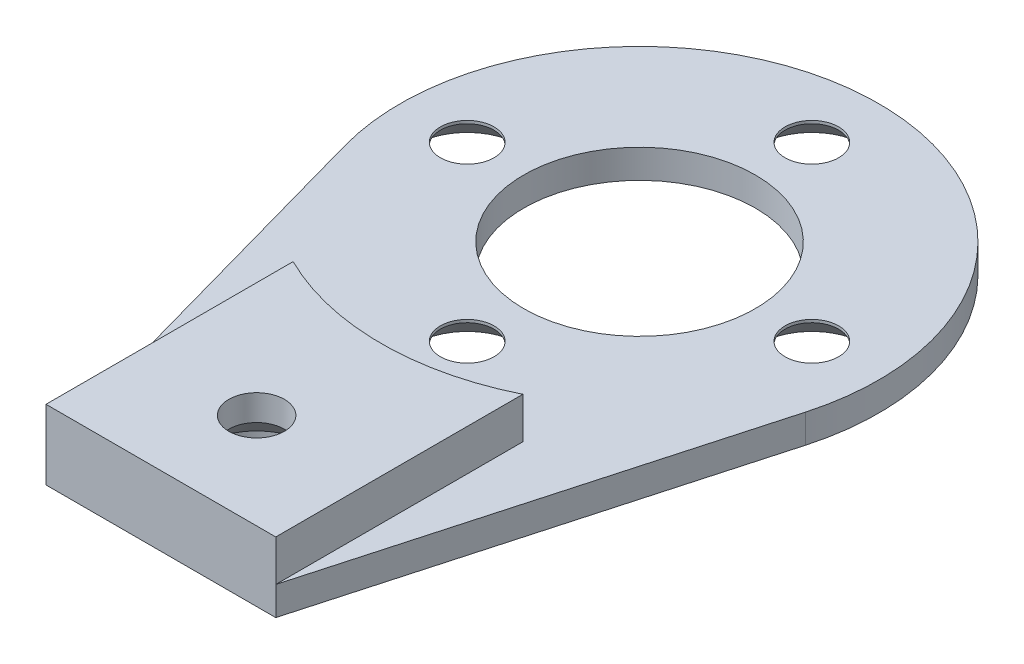
ISO-10303-21;
HEADER;
FILE_DESCRIPTION(('STEP AP214'),'2;1');
FILE_NAME('part.step','',(''),(''),'','','');
FILE_SCHEMA(('AUTOMOTIVE_DESIGN { 1 0 10303 214 1 1 1 1 }'));
ENDSEC;
DATA;
#1=APPLICATION_CONTEXT('core data for automotive mechanical design processes');
#2=APPLICATION_PROTOCOL_DEFINITION('international standard','automotive_design',2000,#1);
#3=PRODUCT_CONTEXT('',#1,'mechanical');
#4=PRODUCT('Part','Part','',(#3));
#5=PRODUCT_RELATED_PRODUCT_CATEGORY('part','',(#4));
#6=PRODUCT_DEFINITION_FORMATION('','',#4);
#7=PRODUCT_DEFINITION_CONTEXT('part definition',#1,'design');
#8=PRODUCT_DEFINITION('design','',#6,#7);
#9=PRODUCT_DEFINITION_SHAPE('','',#8);
#10=(LENGTH_UNIT() NAMED_UNIT(*) SI_UNIT(.MILLI.,.METRE.));
#11=(NAMED_UNIT(*) PLANE_ANGLE_UNIT() SI_UNIT($,.RADIAN.));
#12=(NAMED_UNIT(*) SI_UNIT($,.STERADIAN.) SOLID_ANGLE_UNIT());
#13=UNCERTAINTY_MEASURE_WITH_UNIT(LENGTH_MEASURE(1.E-05),#10,'distance_accuracy_value','');
#14=(GEOMETRIC_REPRESENTATION_CONTEXT(3) GLOBAL_UNCERTAINTY_ASSIGNED_CONTEXT((#13)) GLOBAL_UNIT_ASSIGNED_CONTEXT((#10,
#11,#12)) REPRESENTATION_CONTEXT('',''));
#15=CARTESIAN_POINT('',(0.,0.,0.));
#16=DIRECTION('',(0.,0.,1.));
#17=DIRECTION('',(1.,0.,0.));
#18=AXIS2_PLACEMENT_3D('',#15,#16,#17);
#19=CARTESIAN_POINT('',(0.,1.5,0.));
#20=DIRECTION('',(0.,-1.,0.));
#21=DIRECTION('',(0.,0.,-1.));
#22=AXIS2_PLACEMENT_3D('',#19,#20,#21);
#23=CYLINDRICAL_SURFACE('',#22,12.5);
#24=CARTESIAN_POINT('',(0.,0.,0.));
#25=DIRECTION('',(0.,1.,0.));
#26=DIRECTION('',(0.,0.,1.));
#27=AXIS2_PLACEMENT_3D('',#24,#25,#26);
#28=CIRCLE('',#27,12.5);
#29=CARTESIAN_POINT('',(12.0398269377179,0.,3.3604415349477));
#30=VERTEX_POINT('',#29);
#31=CARTESIAN_POINT('',(-12.0398269377179,0.,3.3604415349477));
#32=VERTEX_POINT('',#31);
#33=EDGE_CURVE('E126',#30,#32,#28,.T.);
#34=ORIENTED_EDGE('',*,*,#33,.T.);
#35=DIRECTION('',(0.,-1.,0.));
#36=VECTOR('',#35,1.);
#37=CARTESIAN_POINT('',(-12.0398269377179,1.5,3.3604415349477));
#38=LINE('',#37,#36);
#39=CARTESIAN_POINT('',(-12.0398269377179,1.5,3.3604415349477));
#40=VERTEX_POINT('',#39);
#41=EDGE_CURVE('E11',#40,#32,#38,.T.);
#42=ORIENTED_EDGE('',*,*,#41,.F.);
#43=CARTESIAN_POINT('',(0.,1.5,0.));
#44=DIRECTION('',(0.,1.,0.));
#45=DIRECTION('',(0.,0.,1.));
#46=AXIS2_PLACEMENT_3D('',#43,#44,#45);
#47=CIRCLE('',#46,12.5);
#48=CARTESIAN_POINT('',(12.0398269377179,1.5,3.3604415349477));
#49=VERTEX_POINT('',#48);
#50=EDGE_CURVE('E135',#49,#40,#47,.T.);
#51=ORIENTED_EDGE('',*,*,#50,.F.);
#52=DIRECTION('',(0.,-1.,0.));
#53=VECTOR('',#52,1.);
#54=CARTESIAN_POINT('',(12.0398269377179,1.5,3.3604415349477));
#55=LINE('',#54,#53);
#56=EDGE_CURVE('E138',#49,#30,#55,.T.);
#57=ORIENTED_EDGE('',*,*,#56,.T.);
#58=EDGE_LOOP('',(#34,#42,#51,#57));
#59=FACE_BOUND('',#58,.T.);
#60=ADVANCED_FACE('F34',(#59),#23,.T.);
#61=CARTESIAN_POINT('',(-12.0398269377179,1.5,3.3604415349477));
#62=DIRECTION('',(0.963186155017435,0.,-0.268835322795816));
#63=DIRECTION('',(-0.268835322795816,0.,-0.963186155017435));
#64=AXIS2_PLACEMENT_3D('',#61,#62,#63);
#65=PLANE('',#64);
#66=DIRECTION('',(0.268835322795816,0.,0.963186155017435));
#67=VECTOR('',#66,1.);
#68=CARTESIAN_POINT('',(-12.0398269377179,0.,3.3604415349477));
#69=LINE('',#68,#67);
#70=CARTESIAN_POINT('',(-6.,0.,25.));
#71=VERTEX_POINT('',#70);
#72=EDGE_CURVE('E129',#32,#71,#69,.T.);
#73=ORIENTED_EDGE('',*,*,#72,.T.);
#74=DIRECTION('',(0.,-1.,0.));
#75=VECTOR('',#74,1.);
#76=CARTESIAN_POINT('',(-6.,1.5,25.));
#77=LINE('',#76,#75);
#78=CARTESIAN_POINT('',(-6.,1.5,25.));
#79=VERTEX_POINT('',#78);
#80=EDGE_CURVE('E42',#79,#71,#77,.T.);
#81=ORIENTED_EDGE('',*,*,#80,.F.);
#82=DIRECTION('',(0.268835322795816,0.,0.963186155017435));
#83=VECTOR('',#82,1.);
#84=CARTESIAN_POINT('',(-12.0398269377179,1.5,3.3604415349477));
#85=LINE('',#84,#83);
#86=EDGE_CURVE('E85',#40,#79,#85,.T.);
#87=ORIENTED_EDGE('',*,*,#86,.F.);
#88=ORIENTED_EDGE('',*,*,#41,.T.);
#89=EDGE_LOOP('',(#73,#81,#87,#88));
#90=FACE_BOUND('',#89,.T.);
#91=ADVANCED_FACE('F221',(#90),#65,.F.);
#92=CARTESIAN_POINT('',(-6.,1.5,25.));
#93=DIRECTION('',(0.,0.,-1.));
#94=DIRECTION('',(-1.,0.,0.));
#95=AXIS2_PLACEMENT_3D('',#92,#93,#94);
#96=PLANE('',#95);
#97=DIRECTION('',(1.,0.,0.));
#98=VECTOR('',#97,1.);
#99=CARTESIAN_POINT('',(-6.,0.,25.));
#100=LINE('',#99,#98);
#101=CARTESIAN_POINT('',(6.,0.,25.));
#102=VERTEX_POINT('',#101);
#103=EDGE_CURVE('E141',#71,#102,#100,.T.);
#104=ORIENTED_EDGE('',*,*,#103,.T.);
#105=DIRECTION('',(0.,-1.,0.));
#106=VECTOR('',#105,1.);
#107=CARTESIAN_POINT('',(6.,1.5,25.));
#108=LINE('',#107,#106);
#109=CARTESIAN_POINT('',(6.,1.5,25.));
#110=VERTEX_POINT('',#109);
#111=EDGE_CURVE('E125',#110,#102,#108,.T.);
#112=ORIENTED_EDGE('',*,*,#111,.F.);
#113=DIRECTION('',(0.,-1.,0.));
#114=VECTOR('',#113,1.);
#115=CARTESIAN_POINT('',(6.,3.65,25.));
#116=LINE('',#115,#114);
#117=CARTESIAN_POINT('',(6.,3.65,25.));
#118=VERTEX_POINT('',#117);
#119=EDGE_CURVE('E107',#118,#110,#116,.T.);
#120=ORIENTED_EDGE('',*,*,#119,.F.);
#121=DIRECTION('',(1.,0.,0.));
#122=VECTOR('',#121,1.);
#123=CARTESIAN_POINT('',(-6.,3.65,25.));
#124=LINE('',#123,#122);
#125=CARTESIAN_POINT('',(-6.,3.65,25.));
#126=VERTEX_POINT('',#125);
#127=EDGE_CURVE('E113',#126,#118,#124,.T.);
#128=ORIENTED_EDGE('',*,*,#127,.F.);
#129=DIRECTION('',(0.,-1.,0.));
#130=VECTOR('',#129,1.);
#131=CARTESIAN_POINT('',(-6.,3.65,25.));
#132=LINE('',#131,#130);
#133=EDGE_CURVE('E192',#126,#79,#132,.T.);
#134=ORIENTED_EDGE('',*,*,#133,.T.);
#135=ORIENTED_EDGE('',*,*,#80,.T.);
#136=EDGE_LOOP('',(#104,#112,#120,#128,#134,#135));
#137=FACE_BOUND('',#136,.T.);
#138=ADVANCED_FACE('F124',(#137),#96,.F.);
#139=CARTESIAN_POINT('',(6.,1.5,25.));
#140=DIRECTION('',(-0.963186155017435,0.,-0.268835322795816));
#141=DIRECTION('',(-0.268835322795816,0.,0.963186155017435));
#142=AXIS2_PLACEMENT_3D('',#139,#140,#141);
#143=PLANE('',#142);
#144=DIRECTION('',(0.268835322795816,0.,-0.963186155017435));
#145=VECTOR('',#144,1.);
#146=CARTESIAN_POINT('',(6.,0.,25.));
#147=LINE('',#146,#145);
#148=EDGE_CURVE('E79',#102,#30,#147,.T.);
#149=ORIENTED_EDGE('',*,*,#148,.T.);
#150=ORIENTED_EDGE('',*,*,#56,.F.);
#151=DIRECTION('',(0.268835322795816,0.,-0.963186155017435));
#152=VECTOR('',#151,1.);
#153=CARTESIAN_POINT('',(6.,1.5,25.));
#154=LINE('',#153,#152);
#155=EDGE_CURVE('E58',#110,#49,#154,.T.);
#156=ORIENTED_EDGE('',*,*,#155,.F.);
#157=ORIENTED_EDGE('',*,*,#111,.T.);
#158=EDGE_LOOP('',(#149,#150,#156,#157));
#159=FACE_BOUND('',#158,.T.);
#160=ADVANCED_FACE('F206',(#159),#143,.F.);
#161=CARTESIAN_POINT('',(0.,1.5,0.));
#162=DIRECTION('',(0.,1.,0.));
#163=DIRECTION('',(0.,0.,1.));
#164=AXIS2_PLACEMENT_3D('',#161,#162,#163);
#165=PLANE('',#164);
#166=CARTESIAN_POINT('',(0.,1.5,0.));
#167=DIRECTION('',(0.,1.,0.));
#168=DIRECTION('',(0.,0.,1.));
#169=AXIS2_PLACEMENT_3D('',#166,#167,#168);
#170=CIRCLE('',#169,6.05);
#171=CARTESIAN_POINT('',(0.,1.5,6.05));
#172=VERTEX_POINT('',#171);
#173=EDGE_CURVE('E176',#172,#172,#170,.T.);
#174=ORIENTED_EDGE('',*,*,#173,.F.);
#175=EDGE_LOOP('',(#174));
#176=FACE_BOUND('',#175,.T.);
#177=CARTESIAN_POINT('',(0.,1.5,9.));
#178=DIRECTION('',(0.,1.,0.));
#179=DIRECTION('',(0.,0.,1.));
#180=AXIS2_PLACEMENT_3D('',#177,#178,#179);
#181=CIRCLE('',#180,1.4);
#182=CARTESIAN_POINT('',(0.,1.5,10.4));
#183=VERTEX_POINT('',#182);
#184=EDGE_CURVE('E162',#183,#183,#181,.T.);
#185=ORIENTED_EDGE('',*,*,#184,.F.);
#186=EDGE_LOOP('',(#185));
#187=FACE_BOUND('',#186,.T.);
#188=CARTESIAN_POINT('',(-9.,1.5,0.));
#189=DIRECTION('',(0.,1.,0.));
#190=DIRECTION('',(0.,0.,1.));
#191=AXIS2_PLACEMENT_3D('',#188,#189,#190);
#192=CIRCLE('',#191,1.4);
#193=CARTESIAN_POINT('',(-9.,1.5,1.4));
#194=VERTEX_POINT('',#193);
#195=EDGE_CURVE('E158',#194,#194,#192,.T.);
#196=ORIENTED_EDGE('',*,*,#195,.F.);
#197=EDGE_LOOP('',(#196));
#198=FACE_BOUND('',#197,.T.);
#199=CARTESIAN_POINT('',(0.,1.5,-9.));
#200=DIRECTION('',(0.,1.,0.));
#201=DIRECTION('',(0.,0.,1.));
#202=AXIS2_PLACEMENT_3D('',#199,#200,#201);
#203=CIRCLE('',#202,1.4);
#204=CARTESIAN_POINT('',(0.,1.5,-7.6));
#205=VERTEX_POINT('',#204);
#206=EDGE_CURVE('E153',#205,#205,#203,.T.);
#207=ORIENTED_EDGE('',*,*,#206,.F.);
#208=EDGE_LOOP('',(#207));
#209=FACE_BOUND('',#208,.T.);
#210=CARTESIAN_POINT('',(9.,1.5,0.));
#211=DIRECTION('',(0.,1.,0.));
#212=DIRECTION('',(0.,0.,1.));
#213=AXIS2_PLACEMENT_3D('',#210,#211,#212);
#214=CIRCLE('',#213,1.4);
#215=CARTESIAN_POINT('',(9.,1.5,1.4));
#216=VERTEX_POINT('',#215);
#217=EDGE_CURVE('E148',#216,#216,#214,.T.);
#218=ORIENTED_EDGE('',*,*,#217,.F.);
#219=EDGE_LOOP('',(#218));
#220=FACE_BOUND('',#219,.T.);
#221=DIRECTION('',(0.,0.,1.));
#222=VECTOR('',#221,1.);
#223=CARTESIAN_POINT('',(-6.,1.5,25.));
#224=LINE('',#223,#222);
#225=CARTESIAN_POINT('',(-6.,1.5,12.0933866224478));
#226=VERTEX_POINT('',#225);
#227=EDGE_CURVE('E50',#226,#79,#224,.T.);
#228=ORIENTED_EDGE('',*,*,#227,.F.);
#229=CARTESIAN_POINT('',(0.,1.5,0.));
#230=DIRECTION('',(0.,-1.,0.));
#231=DIRECTION('',(0.,0.,1.));
#232=AXIS2_PLACEMENT_3D('',#229,#230,#231);
#233=CIRCLE('',#232,13.5);
#234=CARTESIAN_POINT('',(6.,1.5,12.0933866224478));
#235=VERTEX_POINT('',#234);
#236=EDGE_CURVE('E194',#235,#226,#233,.T.);
#237=ORIENTED_EDGE('',*,*,#236,.F.);
#238=DIRECTION('',(0.,0.,-1.));
#239=VECTOR('',#238,1.);
#240=CARTESIAN_POINT('',(6.,1.5,25.));
#241=LINE('',#240,#239);
#242=EDGE_CURVE('E151',#110,#235,#241,.T.);
#243=ORIENTED_EDGE('',*,*,#242,.F.);
#244=ORIENTED_EDGE('',*,*,#155,.T.);
#245=ORIENTED_EDGE('',*,*,#50,.T.);
#246=ORIENTED_EDGE('',*,*,#86,.T.);
#247=EDGE_LOOP('',(#228,#237,#243,#244,#245,#246));
#248=FACE_BOUND('',#247,.T.);
#249=ADVANCED_FACE('F203',(#176,#187,#198,#209,#220,#248),#165,.T.);
#250=CARTESIAN_POINT('',(0.,0.,0.));
#251=DIRECTION('',(0.,1.,0.));
#252=DIRECTION('',(0.,0.,1.));
#253=AXIS2_PLACEMENT_3D('',#250,#251,#252);
#254=PLANE('',#253);
#255=CARTESIAN_POINT('',(0.,0.,20.));
#256=DIRECTION('',(0.,-1.,0.));
#257=DIRECTION('',(0.,0.,-1.));
#258=AXIS2_PLACEMENT_3D('',#255,#256,#257);
#259=CIRCLE('',#258,2.75);
#260=CARTESIAN_POINT('',(0.,0.,17.25));
#261=VERTEX_POINT('',#260);
#262=EDGE_CURVE('E412',#261,#261,#259,.T.);
#263=ORIENTED_EDGE('',*,*,#262,.F.);
#264=EDGE_LOOP('',(#263));
#265=FACE_BOUND('',#264,.T.);
#266=CARTESIAN_POINT('',(0.,0.,0.));
#267=DIRECTION('',(0.,-1.,0.));
#268=DIRECTION('',(0.,0.,-1.));
#269=AXIS2_PLACEMENT_3D('',#266,#267,#268);
#270=CIRCLE('',#269,6.05);
#271=CARTESIAN_POINT('',(0.,0.,-6.05));
#272=VERTEX_POINT('',#271);
#273=EDGE_CURVE('E415',#272,#272,#270,.T.);
#274=ORIENTED_EDGE('',*,*,#273,.F.);
#275=EDGE_LOOP('',(#274));
#276=FACE_BOUND('',#275,.T.);
#277=CARTESIAN_POINT('',(0.,0.,9.));
#278=DIRECTION('',(0.,-1.,0.));
#279=DIRECTION('',(0.,0.,-1.));
#280=AXIS2_PLACEMENT_3D('',#277,#278,#279);
#281=CIRCLE('',#280,2.75);
#282=CARTESIAN_POINT('',(0.,0.,6.25));
#283=VERTEX_POINT('',#282);
#284=EDGE_CURVE('E171',#283,#283,#281,.T.);
#285=ORIENTED_EDGE('',*,*,#284,.F.);
#286=EDGE_LOOP('',(#285));
#287=FACE_BOUND('',#286,.T.);
#288=CARTESIAN_POINT('',(-9.,0.,0.));
#289=DIRECTION('',(0.,-1.,0.));
#290=DIRECTION('',(0.,0.,-1.));
#291=AXIS2_PLACEMENT_3D('',#288,#289,#290);
#292=CIRCLE('',#291,2.75);
#293=CARTESIAN_POINT('',(-9.,0.,-2.75));
#294=VERTEX_POINT('',#293);
#295=EDGE_CURVE('E164',#294,#294,#292,.T.);
#296=ORIENTED_EDGE('',*,*,#295,.F.);
#297=EDGE_LOOP('',(#296));
#298=FACE_BOUND('',#297,.T.);
#299=CARTESIAN_POINT('',(0.,0.,-9.));
#300=DIRECTION('',(0.,-1.,0.));
#301=DIRECTION('',(0.,0.,-1.));
#302=AXIS2_PLACEMENT_3D('',#299,#300,#301);
#303=CIRCLE('',#302,2.75);
#304=CARTESIAN_POINT('',(0.,0.,-11.75));
#305=VERTEX_POINT('',#304);
#306=EDGE_CURVE('E160',#305,#305,#303,.T.);
#307=ORIENTED_EDGE('',*,*,#306,.F.);
#308=EDGE_LOOP('',(#307));
#309=FACE_BOUND('',#308,.T.);
#310=CARTESIAN_POINT('',(9.,0.,0.));
#311=DIRECTION('',(0.,-1.,0.));
#312=DIRECTION('',(0.,0.,-1.));
#313=AXIS2_PLACEMENT_3D('',#310,#311,#312);
#314=CIRCLE('',#313,2.75);
#315=CARTESIAN_POINT('',(9.,0.,-2.75));
#316=VERTEX_POINT('',#315);
#317=EDGE_CURVE('E156',#316,#316,#314,.T.);
#318=ORIENTED_EDGE('',*,*,#317,.F.);
#319=EDGE_LOOP('',(#318));
#320=FACE_BOUND('',#319,.T.);
#321=ORIENTED_EDGE('',*,*,#33,.F.);
#322=ORIENTED_EDGE('',*,*,#148,.F.);
#323=ORIENTED_EDGE('',*,*,#103,.F.);
#324=ORIENTED_EDGE('',*,*,#72,.F.);
#325=EDGE_LOOP('',(#321,#322,#323,#324));
#326=FACE_BOUND('',#325,.T.);
#327=ADVANCED_FACE('F205',(#265,#276,#287,#298,#309,#320,#326),#254,.F.);
#328=CARTESIAN_POINT('',(6.,3.65,25.));
#329=DIRECTION('',(-1.,0.,0.));
#330=DIRECTION('',(0.,0.,1.));
#331=AXIS2_PLACEMENT_3D('',#328,#329,#330);
#332=PLANE('',#331);
#333=ORIENTED_EDGE('',*,*,#242,.T.);
#334=DIRECTION('',(0.,-1.,0.));
#335=VECTOR('',#334,1.);
#336=CARTESIAN_POINT('',(6.,3.65,12.0933866224478));
#337=LINE('',#336,#335);
#338=CARTESIAN_POINT('',(6.,3.65,12.0933866224478));
#339=VERTEX_POINT('',#338);
#340=EDGE_CURVE('E109',#339,#235,#337,.T.);
#341=ORIENTED_EDGE('',*,*,#340,.F.);
#342=DIRECTION('',(0.,0.,-1.));
#343=VECTOR('',#342,1.);
#344=CARTESIAN_POINT('',(6.,3.65,25.));
#345=LINE('',#344,#343);
#346=EDGE_CURVE('E102',#118,#339,#345,.T.);
#347=ORIENTED_EDGE('',*,*,#346,.F.);
#348=ORIENTED_EDGE('',*,*,#119,.T.);
#349=EDGE_LOOP('',(#333,#341,#347,#348));
#350=FACE_BOUND('',#349,.T.);
#351=ADVANCED_FACE('F105',(#350),#332,.F.);
#352=CARTESIAN_POINT('',(0.,3.65,0.));
#353=DIRECTION('',(0.,-1.,0.));
#354=DIRECTION('',(0.,0.,-1.));
#355=AXIS2_PLACEMENT_3D('',#352,#353,#354);
#356=CYLINDRICAL_SURFACE('',#355,13.5);
#357=ORIENTED_EDGE('',*,*,#236,.T.);
#358=DIRECTION('',(0.,-1.,0.));
#359=VECTOR('',#358,1.);
#360=CARTESIAN_POINT('',(-6.,3.65,12.0933866224478));
#361=LINE('',#360,#359);
#362=CARTESIAN_POINT('',(-6.,3.65,12.0933866224478));
#363=VERTEX_POINT('',#362);
#364=EDGE_CURVE('E131',#363,#226,#361,.T.);
#365=ORIENTED_EDGE('',*,*,#364,.F.);
#366=CARTESIAN_POINT('',(0.,3.65,0.));
#367=DIRECTION('',(0.,-1.,0.));
#368=DIRECTION('',(0.,0.,1.));
#369=AXIS2_PLACEMENT_3D('',#366,#367,#368);
#370=CIRCLE('',#369,13.5);
#371=EDGE_CURVE('E112',#339,#363,#370,.T.);
#372=ORIENTED_EDGE('',*,*,#371,.F.);
#373=ORIENTED_EDGE('',*,*,#340,.T.);
#374=EDGE_LOOP('',(#357,#365,#372,#373));
#375=FACE_BOUND('',#374,.T.);
#376=ADVANCED_FACE('F202',(#375),#356,.F.);
#377=CARTESIAN_POINT('',(-6.,3.65,25.));
#378=DIRECTION('',(1.,0.,0.));
#379=DIRECTION('',(0.,0.,-1.));
#380=AXIS2_PLACEMENT_3D('',#377,#378,#379);
#381=PLANE('',#380);
#382=ORIENTED_EDGE('',*,*,#227,.T.);
#383=ORIENTED_EDGE('',*,*,#133,.F.);
#384=DIRECTION('',(0.,0.,1.));
#385=VECTOR('',#384,1.);
#386=CARTESIAN_POINT('',(-6.,3.65,25.));
#387=LINE('',#386,#385);
#388=EDGE_CURVE('E118',#363,#126,#387,.T.);
#389=ORIENTED_EDGE('',*,*,#388,.F.);
#390=ORIENTED_EDGE('',*,*,#364,.T.);
#391=EDGE_LOOP('',(#382,#383,#389,#390));
#392=FACE_BOUND('',#391,.T.);
#393=ADVANCED_FACE('F200',(#392),#381,.F.);
#394=CARTESIAN_POINT('',(0.,3.65,0.));
#395=DIRECTION('',(0.,1.,0.));
#396=DIRECTION('',(0.,0.,1.));
#397=AXIS2_PLACEMENT_3D('',#394,#395,#396);
#398=PLANE('',#397);
#399=CARTESIAN_POINT('',(0.,3.65,20.));
#400=DIRECTION('',(0.,1.,0.));
#401=DIRECTION('',(0.,0.,1.));
#402=AXIS2_PLACEMENT_3D('',#399,#400,#401);
#403=CIRCLE('',#402,1.45);
#404=CARTESIAN_POINT('',(0.,3.65,21.45));
#405=VERTEX_POINT('',#404);
#406=EDGE_CURVE('E37',#405,#405,#403,.T.);
#407=ORIENTED_EDGE('',*,*,#406,.F.);
#408=EDGE_LOOP('',(#407));
#409=FACE_BOUND('',#408,.T.);
#410=ORIENTED_EDGE('',*,*,#127,.T.);
#411=ORIENTED_EDGE('',*,*,#346,.T.);
#412=ORIENTED_EDGE('',*,*,#371,.T.);
#413=ORIENTED_EDGE('',*,*,#388,.T.);
#414=EDGE_LOOP('',(#410,#411,#412,#413));
#415=FACE_BOUND('',#414,.T.);
#416=ADVANCED_FACE('F116',(#409,#415),#398,.T.);
#417=CARTESIAN_POINT('',(9.,0.,0.));
#418=DIRECTION('',(0.,-1.,0.));
#419=DIRECTION('',(0.,0.,-1.));
#420=AXIS2_PLACEMENT_3D('',#417,#418,#419);
#421=CYLINDRICAL_SURFACE('',#420,1.4);
#422=ORIENTED_EDGE('',*,*,#217,.T.);
#423=EDGE_LOOP('',(#422));
#424=FACE_BOUND('',#423,.T.);
#425=CARTESIAN_POINT('',(9.,1.35,0.));
#426=DIRECTION('',(0.,-1.,0.));
#427=DIRECTION('',(0.,0.,-1.));
#428=AXIS2_PLACEMENT_3D('',#425,#426,#427);
#429=CIRCLE('',#428,1.4);
#430=CARTESIAN_POINT('',(9.,1.35,-1.4));
#431=VERTEX_POINT('',#430);
#432=EDGE_CURVE('E152',#431,#431,#429,.T.);
#433=ORIENTED_EDGE('',*,*,#432,.T.);
#434=EDGE_LOOP('',(#433));
#435=FACE_BOUND('',#434,.T.);
#436=ADVANCED_FACE('F273',(#424,#435),#421,.F.);
#437=CARTESIAN_POINT('',(9.,0.,0.));
#438=DIRECTION('',(0.,-1.,0.));
#439=DIRECTION('',(0.,0.,-1.));
#440=AXIS2_PLACEMENT_3D('',#437,#438,#439);
#441=CONICAL_SURFACE('',#440,2.75,0.785398163397449);
#442=ORIENTED_EDGE('',*,*,#432,.F.);
#443=EDGE_LOOP('',(#442));
#444=FACE_BOUND('',#443,.T.);
#445=ORIENTED_EDGE('',*,*,#317,.T.);
#446=EDGE_LOOP('',(#445));
#447=FACE_BOUND('',#446,.T.);
#448=ADVANCED_FACE('F278',(#444,#447),#441,.F.);
#449=CARTESIAN_POINT('',(0.,0.,-9.));
#450=DIRECTION('',(0.,-1.,0.));
#451=DIRECTION('',(0.,0.,-1.));
#452=AXIS2_PLACEMENT_3D('',#449,#450,#451);
#453=CYLINDRICAL_SURFACE('',#452,1.4);
#454=ORIENTED_EDGE('',*,*,#206,.T.);
#455=EDGE_LOOP('',(#454));
#456=FACE_BOUND('',#455,.T.);
#457=CARTESIAN_POINT('',(0.,1.35,-9.));
#458=DIRECTION('',(0.,-1.,0.));
#459=DIRECTION('',(0.,0.,-1.));
#460=AXIS2_PLACEMENT_3D('',#457,#458,#459);
#461=CIRCLE('',#460,1.4);
#462=CARTESIAN_POINT('',(0.,1.35,-10.4));
#463=VERTEX_POINT('',#462);
#464=EDGE_CURVE('E157',#463,#463,#461,.T.);
#465=ORIENTED_EDGE('',*,*,#464,.T.);
#466=EDGE_LOOP('',(#465));
#467=FACE_BOUND('',#466,.T.);
#468=ADVANCED_FACE('F288',(#456,#467),#453,.F.);
#469=CARTESIAN_POINT('',(0.,0.,-9.));
#470=DIRECTION('',(0.,-1.,0.));
#471=DIRECTION('',(0.,0.,-1.));
#472=AXIS2_PLACEMENT_3D('',#469,#470,#471);
#473=CONICAL_SURFACE('',#472,2.75,0.785398163397449);
#474=ORIENTED_EDGE('',*,*,#464,.F.);
#475=EDGE_LOOP('',(#474));
#476=FACE_BOUND('',#475,.T.);
#477=ORIENTED_EDGE('',*,*,#306,.T.);
#478=EDGE_LOOP('',(#477));
#479=FACE_BOUND('',#478,.T.);
#480=ADVANCED_FACE('F298',(#476,#479),#473,.F.);
#481=CARTESIAN_POINT('',(-9.,0.,0.));
#482=DIRECTION('',(0.,-1.,0.));
#483=DIRECTION('',(0.,0.,-1.));
#484=AXIS2_PLACEMENT_3D('',#481,#482,#483);
#485=CYLINDRICAL_SURFACE('',#484,1.4);
#486=ORIENTED_EDGE('',*,*,#195,.T.);
#487=EDGE_LOOP('',(#486));
#488=FACE_BOUND('',#487,.T.);
#489=CARTESIAN_POINT('',(-9.,1.35,0.));
#490=DIRECTION('',(0.,-1.,0.));
#491=DIRECTION('',(0.,0.,-1.));
#492=AXIS2_PLACEMENT_3D('',#489,#490,#491);
#493=CIRCLE('',#492,1.4);
#494=CARTESIAN_POINT('',(-9.,1.35,-1.4));
#495=VERTEX_POINT('',#494);
#496=EDGE_CURVE('E161',#495,#495,#493,.T.);
#497=ORIENTED_EDGE('',*,*,#496,.T.);
#498=EDGE_LOOP('',(#497));
#499=FACE_BOUND('',#498,.T.);
#500=ADVANCED_FACE('F308',(#488,#499),#485,.F.);
#501=CARTESIAN_POINT('',(-9.,0.,0.));
#502=DIRECTION('',(0.,-1.,0.));
#503=DIRECTION('',(0.,0.,-1.));
#504=AXIS2_PLACEMENT_3D('',#501,#502,#503);
#505=CONICAL_SURFACE('',#504,2.75,0.785398163397449);
#506=ORIENTED_EDGE('',*,*,#496,.F.);
#507=EDGE_LOOP('',(#506));
#508=FACE_BOUND('',#507,.T.);
#509=ORIENTED_EDGE('',*,*,#295,.T.);
#510=EDGE_LOOP('',(#509));
#511=FACE_BOUND('',#510,.T.);
#512=ADVANCED_FACE('F318',(#508,#511),#505,.F.);
#513=CARTESIAN_POINT('',(0.,0.,9.));
#514=DIRECTION('',(0.,-1.,0.));
#515=DIRECTION('',(0.,0.,-1.));
#516=AXIS2_PLACEMENT_3D('',#513,#514,#515);
#517=CYLINDRICAL_SURFACE('',#516,1.4);
#518=ORIENTED_EDGE('',*,*,#184,.T.);
#519=EDGE_LOOP('',(#518));
#520=FACE_BOUND('',#519,.T.);
#521=CARTESIAN_POINT('',(0.,1.35,9.));
#522=DIRECTION('',(0.,-1.,0.));
#523=DIRECTION('',(0.,0.,-1.));
#524=AXIS2_PLACEMENT_3D('',#521,#522,#523);
#525=CIRCLE('',#524,1.4);
#526=CARTESIAN_POINT('',(0.,1.35,7.6));
#527=VERTEX_POINT('',#526);
#528=EDGE_CURVE('E165',#527,#527,#525,.T.);
#529=ORIENTED_EDGE('',*,*,#528,.T.);
#530=EDGE_LOOP('',(#529));
#531=FACE_BOUND('',#530,.T.);
#532=ADVANCED_FACE('F328',(#520,#531),#517,.F.);
#533=CARTESIAN_POINT('',(0.,0.,9.));
#534=DIRECTION('',(0.,-1.,0.));
#535=DIRECTION('',(0.,0.,-1.));
#536=AXIS2_PLACEMENT_3D('',#533,#534,#535);
#537=CONICAL_SURFACE('',#536,2.75,0.785398163397449);
#538=ORIENTED_EDGE('',*,*,#528,.F.);
#539=EDGE_LOOP('',(#538));
#540=FACE_BOUND('',#539,.T.);
#541=ORIENTED_EDGE('',*,*,#284,.T.);
#542=EDGE_LOOP('',(#541));
#543=FACE_BOUND('',#542,.T.);
#544=ADVANCED_FACE('F338',(#540,#543),#537,.F.);
#545=CARTESIAN_POINT('',(0.,3.65,0.));
#546=DIRECTION('',(0.,-1.,0.));
#547=DIRECTION('',(0.,0.,-1.));
#548=AXIS2_PLACEMENT_3D('',#545,#546,#547);
#549=CYLINDRICAL_SURFACE('',#548,6.05);
#550=ORIENTED_EDGE('',*,*,#173,.T.);
#551=EDGE_LOOP('',(#550));
#552=FACE_BOUND('',#551,.T.);
#553=ORIENTED_EDGE('',*,*,#273,.T.);
#554=EDGE_LOOP('',(#553));
#555=FACE_BOUND('',#554,.T.);
#556=ADVANCED_FACE('F346',(#552,#555),#549,.F.);
#557=CARTESIAN_POINT('',(0.,1.,20.));
#558=DIRECTION('',(0.,-1.,0.));
#559=DIRECTION('',(0.,0.,-1.));
#560=AXIS2_PLACEMENT_3D('',#557,#558,#559);
#561=CYLINDRICAL_SURFACE('',#560,2.75);
#562=CARTESIAN_POINT('',(0.,1.,20.));
#563=DIRECTION('',(0.,-1.,0.));
#564=DIRECTION('',(0.,0.,-1.));
#565=AXIS2_PLACEMENT_3D('',#562,#563,#564);
#566=CIRCLE('',#565,2.75);
#567=CARTESIAN_POINT('',(0.,1.,17.25));
#568=VERTEX_POINT('',#567);
#569=EDGE_CURVE('E408',#568,#568,#566,.T.);
#570=ORIENTED_EDGE('',*,*,#569,.F.);
#571=EDGE_LOOP('',(#570));
#572=FACE_BOUND('',#571,.T.);
#573=ORIENTED_EDGE('',*,*,#262,.T.);
#574=EDGE_LOOP('',(#573));
#575=FACE_BOUND('',#574,.T.);
#576=ADVANCED_FACE('F360',(#572,#575),#561,.F.);
#577=CARTESIAN_POINT('',(0.,1.,20.));
#578=DIRECTION('',(0.,-1.,0.));
#579=DIRECTION('',(0.,0.,-1.));
#580=AXIS2_PLACEMENT_3D('',#577,#578,#579);
#581=CYLINDRICAL_SURFACE('',#580,1.45);
#582=ORIENTED_EDGE('',*,*,#406,.T.);
#583=EDGE_LOOP('',(#582));
#584=FACE_BOUND('',#583,.T.);
#585=CARTESIAN_POINT('',(0.,2.3,20.));
#586=DIRECTION('',(0.,-1.,0.));
#587=DIRECTION('',(0.,0.,-1.));
#588=AXIS2_PLACEMENT_3D('',#585,#586,#587);
#589=CIRCLE('',#588,1.45);
#590=CARTESIAN_POINT('',(0.,2.3,18.55));
#591=VERTEX_POINT('',#590);
#592=EDGE_CURVE('E405',#591,#591,#589,.T.);
#593=ORIENTED_EDGE('',*,*,#592,.T.);
#594=EDGE_LOOP('',(#593));
#595=FACE_BOUND('',#594,.T.);
#596=ADVANCED_FACE('F373',(#584,#595),#581,.F.);
#597=CARTESIAN_POINT('',(0.,1.,20.));
#598=DIRECTION('',(0.,-1.,0.));
#599=DIRECTION('',(0.,0.,-1.));
#600=AXIS2_PLACEMENT_3D('',#597,#598,#599);
#601=CONICAL_SURFACE('',#600,2.75,0.785398163397449);
#602=ORIENTED_EDGE('',*,*,#592,.F.);
#603=EDGE_LOOP('',(#602));
#604=FACE_BOUND('',#603,.T.);
#605=ORIENTED_EDGE('',*,*,#569,.T.);
#606=EDGE_LOOP('',(#605));
#607=FACE_BOUND('',#606,.T.);
#608=ADVANCED_FACE('F388',(#604,#607),#601,.F.);
#609=CLOSED_SHELL('',(#60,#91,#138,#160,#249,#327,#351,#376,#393,#416,#436,#448,#468,#480,#500,
#512,#532,#544,#556,#576,#596,#608));
#610=MANIFOLD_SOLID_BREP('B2',#609);
#611=ADVANCED_BREP_SHAPE_REPRESENTATION('',(#18,#610),#14);
#612=SHAPE_DEFINITION_REPRESENTATION(#9,#611);
ENDSEC;
END-ISO-10303-21;
